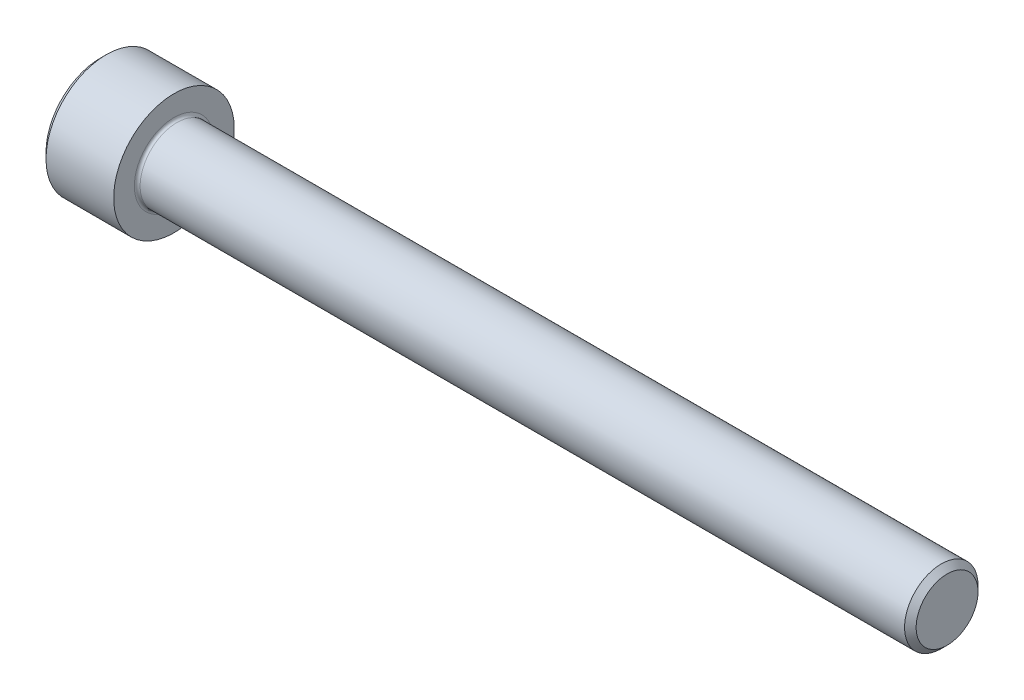
ISO-10303-21;
HEADER;
FILE_DESCRIPTION(('STEP AP214'),'2;1');
FILE_NAME('part.step','',(''),(''),'','','');
FILE_SCHEMA(('AUTOMOTIVE_DESIGN { 1 0 10303 214 1 1 1 1 }'));
ENDSEC;
DATA;
#1=APPLICATION_CONTEXT('core data for automotive mechanical design processes');
#2=APPLICATION_PROTOCOL_DEFINITION('international standard','automotive_design',2000,#1);
#3=PRODUCT_CONTEXT('',#1,'mechanical');
#4=PRODUCT('Part','Part','',(#3));
#5=PRODUCT_RELATED_PRODUCT_CATEGORY('part','',(#4));
#6=PRODUCT_DEFINITION_FORMATION('','',#4);
#7=PRODUCT_DEFINITION_CONTEXT('part definition',#1,'design');
#8=PRODUCT_DEFINITION('design','',#6,#7);
#9=PRODUCT_DEFINITION_SHAPE('','',#8);
#10=(LENGTH_UNIT() NAMED_UNIT(*) SI_UNIT(.MILLI.,.METRE.));
#11=(NAMED_UNIT(*) PLANE_ANGLE_UNIT() SI_UNIT($,.RADIAN.));
#12=(NAMED_UNIT(*) SI_UNIT($,.STERADIAN.) SOLID_ANGLE_UNIT());
#13=UNCERTAINTY_MEASURE_WITH_UNIT(LENGTH_MEASURE(1.E-05),#10,'distance_accuracy_value','');
#14=(GEOMETRIC_REPRESENTATION_CONTEXT(3) GLOBAL_UNCERTAINTY_ASSIGNED_CONTEXT((#13)) GLOBAL_UNIT_ASSIGNED_CONTEXT((#10,
#11,#12)) REPRESENTATION_CONTEXT('',''));
#15=CARTESIAN_POINT('',(0.,0.,0.));
#16=DIRECTION('',(0.,0.,1.));
#17=DIRECTION('',(1.,0.,0.));
#18=AXIS2_PLACEMENT_3D('',#15,#16,#17);
#19=CARTESIAN_POINT('',(0.,0.,0.));
#20=DIRECTION('',(-1.,0.,0.));
#21=DIRECTION('',(0.,0.,1.));
#22=AXIS2_PLACEMENT_3D('',#19,#20,#21);
#23=PLANE('',#22);
#24=CARTESIAN_POINT('',(0.,0.,0.));
#25=DIRECTION('',(-1.,0.,0.));
#26=DIRECTION('',(0.,0.,1.));
#27=AXIS2_PLACEMENT_3D('',#24,#25,#26);
#28=CIRCLE('',#27,3.58139999999999);
#29=CARTESIAN_POINT('',(0.,0.,3.58139999999999));
#30=VERTEX_POINT('',#29);
#31=EDGE_CURVE('E188',#30,#30,#28,.T.);
#32=ORIENTED_EDGE('',*,*,#31,.T.);
#33=EDGE_LOOP('',(#32));
#34=FACE_BOUND('',#33,.T.);
#35=CARTESIAN_POINT('',(0.,0.,0.));
#36=DIRECTION('',(1.,0.,0.));
#37=DIRECTION('',(0.,0.,-1.));
#38=AXIS2_PLACEMENT_3D('',#35,#36,#37);
#39=CIRCLE('',#38,2.29135888084633);
#40=CARTESIAN_POINT('',(0.,1.984375,1.14567944042316));
#41=VERTEX_POINT('',#40);
#42=CARTESIAN_POINT('',(0.,0.,2.29135888084633));
#43=VERTEX_POINT('',#42);
#44=EDGE_CURVE('E107',#41,#43,#39,.T.);
#45=ORIENTED_EDGE('',*,*,#44,.T.);
#46=CARTESIAN_POINT('',(0.,-1.984375,1.14567944042316));
#47=VERTEX_POINT('',#46);
#48=EDGE_CURVE('E135',#43,#47,#39,.T.);
#49=ORIENTED_EDGE('',*,*,#48,.T.);
#50=CARTESIAN_POINT('',(0.,-1.984375,-1.14567944042317));
#51=VERTEX_POINT('',#50);
#52=EDGE_CURVE('E134',#47,#51,#39,.T.);
#53=ORIENTED_EDGE('',*,*,#52,.T.);
#54=CARTESIAN_POINT('',(0.,0.,-2.29135888084633));
#55=VERTEX_POINT('',#54);
#56=EDGE_CURVE('E133',#51,#55,#39,.T.);
#57=ORIENTED_EDGE('',*,*,#56,.T.);
#58=CARTESIAN_POINT('',(0.,1.984375,-1.14567944042316));
#59=VERTEX_POINT('',#58);
#60=EDGE_CURVE('E106',#55,#59,#39,.T.);
#61=ORIENTED_EDGE('',*,*,#60,.T.);
#62=EDGE_CURVE('E99',#59,#41,#39,.T.);
#63=ORIENTED_EDGE('',*,*,#62,.T.);
#64=EDGE_LOOP('',(#45,#49,#53,#57,#61,#63));
#65=FACE_BOUND('',#64,.T.);
#66=ADVANCED_FACE('F39',(#34,#65),#23,.T.);
#67=CARTESIAN_POINT('',(55.626,0.,0.));
#68=DIRECTION('',(1.,0.,0.));
#69=DIRECTION('',(0.,0.,-1.));
#70=AXIS2_PLACEMENT_3D('',#67,#68,#69);
#71=CYLINDRICAL_SURFACE('',#70,3.9624);
#72=CARTESIAN_POINT('',(0.381000000000006,0.,0.));
#73=DIRECTION('',(-1.,0.,0.));
#74=DIRECTION('',(0.,0.,1.));
#75=AXIS2_PLACEMENT_3D('',#72,#73,#74);
#76=CIRCLE('',#75,3.9624);
#77=CARTESIAN_POINT('',(0.381000000000006,0.,3.9624));
#78=VERTEX_POINT('',#77);
#79=EDGE_CURVE('E185',#78,#78,#76,.F.);
#80=ORIENTED_EDGE('',*,*,#79,.T.);
#81=EDGE_LOOP('',(#80));
#82=FACE_BOUND('',#81,.T.);
#83=CARTESIAN_POINT('',(4.826,0.,0.));
#84=DIRECTION('',(1.,0.,0.));
#85=DIRECTION('',(0.,0.,-1.));
#86=AXIS2_PLACEMENT_3D('',#83,#84,#85);
#87=CIRCLE('',#86,3.9624);
#88=CARTESIAN_POINT('',(4.826,0.,-3.9624));
#89=VERTEX_POINT('',#88);
#90=EDGE_CURVE('E176',#89,#89,#87,.T.);
#91=ORIENTED_EDGE('',*,*,#90,.F.);
#92=EDGE_LOOP('',(#91));
#93=FACE_BOUND('',#92,.T.);
#94=ADVANCED_FACE('F223',(#82,#93),#71,.T.);
#95=CARTESIAN_POINT('',(4.826,0.,-3.9624));
#96=DIRECTION('',(1.,0.,0.));
#97=DIRECTION('',(0.,0.,-1.));
#98=AXIS2_PLACEMENT_3D('',#95,#96,#97);
#99=PLANE('',#98);
#100=CARTESIAN_POINT('',(4.826,0.,0.));
#101=DIRECTION('',(1.,0.,0.));
#102=DIRECTION('',(0.,0.,-1.));
#103=AXIS2_PLACEMENT_3D('',#100,#101,#102);
#104=CIRCLE('',#103,2.60349999999999);
#105=CARTESIAN_POINT('',(4.826,0.,-2.60349999999999));
#106=VERTEX_POINT('',#105);
#107=EDGE_CURVE('E53',#106,#106,#104,.F.);
#108=ORIENTED_EDGE('',*,*,#107,.T.);
#109=EDGE_LOOP('',(#108));
#110=FACE_BOUND('',#109,.T.);
#111=ORIENTED_EDGE('',*,*,#90,.T.);
#112=EDGE_LOOP('',(#111));
#113=FACE_BOUND('',#112,.T.);
#114=ADVANCED_FACE('F196',(#110,#113),#99,.T.);
#115=CARTESIAN_POINT('',(55.626,0.,0.));
#116=DIRECTION('',(1.,0.,0.));
#117=DIRECTION('',(0.,0.,-1.));
#118=AXIS2_PLACEMENT_3D('',#115,#116,#117);
#119=CYLINDRICAL_SURFACE('',#118,2.41299999999999);
#120=CARTESIAN_POINT('',(5.0165,0.,0.));
#121=DIRECTION('',(1.,0.,0.));
#122=DIRECTION('',(0.,0.,-1.));
#123=AXIS2_PLACEMENT_3D('',#120,#121,#122);
#124=CIRCLE('',#123,2.41299999999999);
#125=CARTESIAN_POINT('',(5.0165,0.,-2.41299999999999));
#126=VERTEX_POINT('',#125);
#127=EDGE_CURVE('E191',#126,#126,#124,.T.);
#128=ORIENTED_EDGE('',*,*,#127,.T.);
#129=EDGE_LOOP('',(#128));
#130=FACE_BOUND('',#129,.T.);
#131=CARTESIAN_POINT('',(55.245,0.,0.));
#132=DIRECTION('',(1.,0.,0.));
#133=DIRECTION('',(0.,0.,-1.));
#134=AXIS2_PLACEMENT_3D('',#131,#132,#133);
#135=CIRCLE('',#134,2.41299999999999);
#136=CARTESIAN_POINT('',(55.245,0.,-2.413));
#137=VERTEX_POINT('',#136);
#138=EDGE_CURVE('E182',#137,#137,#135,.F.);
#139=ORIENTED_EDGE('',*,*,#138,.T.);
#140=EDGE_LOOP('',(#139));
#141=FACE_BOUND('',#140,.T.);
#142=ADVANCED_FACE('F204',(#130,#141),#119,.T.);
#143=CARTESIAN_POINT('',(55.626,0.,-2.413));
#144=DIRECTION('',(1.,0.,0.));
#145=DIRECTION('',(0.,0.,-1.));
#146=AXIS2_PLACEMENT_3D('',#143,#144,#145);
#147=PLANE('',#146);
#148=CARTESIAN_POINT('',(55.626,0.,0.));
#149=DIRECTION('',(1.,0.,0.));
#150=DIRECTION('',(0.,0.,-1.));
#151=AXIS2_PLACEMENT_3D('',#148,#149,#150);
#152=CIRCLE('',#151,2.03199999999999);
#153=CARTESIAN_POINT('',(55.626,0.,-2.03199999999999));
#154=VERTEX_POINT('',#153);
#155=EDGE_CURVE('E179',#154,#154,#152,.T.);
#156=ORIENTED_EDGE('',*,*,#155,.T.);
#157=EDGE_LOOP('',(#156));
#158=FACE_BOUND('',#157,.T.);
#159=ADVANCED_FACE('F207',(#158),#147,.T.);
#160=CARTESIAN_POINT('',(55.626,0.,0.));
#161=DIRECTION('',(-1.,0.,0.));
#162=DIRECTION('',(0.,0.,1.));
#163=AXIS2_PLACEMENT_3D('',#160,#161,#162);
#164=CONICAL_SURFACE('',#163,2.03199999999999,0.785398163397443);
#165=ORIENTED_EDGE('',*,*,#138,.F.);
#166=EDGE_LOOP('',(#165));
#167=FACE_BOUND('',#166,.T.);
#168=ORIENTED_EDGE('',*,*,#155,.F.);
#169=EDGE_LOOP('',(#168));
#170=FACE_BOUND('',#169,.T.);
#171=ADVANCED_FACE('F211',(#167,#170),#164,.T.);
#172=CARTESIAN_POINT('',(0.381000000000006,0.,0.));
#173=DIRECTION('',(1.,0.,0.));
#174=DIRECTION('',(0.,0.,-1.));
#175=AXIS2_PLACEMENT_3D('',#172,#173,#174);
#176=CONICAL_SURFACE('',#175,3.9624,0.78539816339745);
#177=ORIENTED_EDGE('',*,*,#31,.F.);
#178=EDGE_LOOP('',(#177));
#179=FACE_BOUND('',#178,.T.);
#180=ORIENTED_EDGE('',*,*,#79,.F.);
#181=EDGE_LOOP('',(#180));
#182=FACE_BOUND('',#181,.T.);
#183=ADVANCED_FACE('F201',(#179,#182),#176,.T.);
#184=CARTESIAN_POINT('',(5.0165,0.,0.));
#185=DIRECTION('',(1.,0.,0.));
#186=DIRECTION('',(0.,0.,-1.));
#187=AXIS2_PLACEMENT_3D('',#184,#185,#186);
#188=TOROIDAL_SURFACE('',#187,2.60349999999999,0.1905);
#189=ORIENTED_EDGE('',*,*,#107,.F.);
#190=EDGE_LOOP('',(#189));
#191=FACE_BOUND('',#190,.T.);
#192=ORIENTED_EDGE('',*,*,#127,.F.);
#193=EDGE_LOOP('',(#192));
#194=FACE_BOUND('',#193,.T.);
#195=ADVANCED_FACE('F41',(#191,#194),#188,.F.);
#196=CARTESIAN_POINT('',(0.,0.,0.));
#197=DIRECTION('',(-1.,0.,0.));
#198=DIRECTION('',(0.,0.,-1.));
#199=AXIS2_PLACEMENT_3D('',#196,#197,#198);
#200=CONICAL_SURFACE('',#199,2.29135888084633,0.78539816339745);
#201=CARTESIAN_POINT('',(-0.000115478781842915,-0.000199999999999134,-2.29147435090017));
#202=CARTESIAN_POINT('',(0.0392371477360851,0.0680159951668033,-2.25208982772757));
#203=CARTESIAN_POINT('',(0.0762786895538152,0.137372685106967,-2.21204672412052));
#204=CARTESIAN_POINT('',(0.144101141576677,0.278798800452189,-2.13039431835551));
#205=CARTESIAN_POINT('',(0.174844310908247,0.350881678736784,-2.08877724917394));
#206=CARTESIAN_POINT('',(0.227508111188787,0.496233397266005,-2.00485839535392));
#207=CARTESIAN_POINT('',(0.249561124120036,0.56946521248694,-1.96257798712287));
#208=CARTESIAN_POINT('',(0.283538507056124,0.717541182594707,-1.87708628592063));
#209=CARTESIAN_POINT('',(0.295488243908271,0.792380812753426,-1.83387760530244));
#210=CARTESIAN_POINT('',(0.306269900918094,0.921360414543817,-1.75941119748879));
#211=CARTESIAN_POINT('',(0.307866100940931,0.975333715772444,-1.72824969749539));
#212=CARTESIAN_POINT('',(0.305178161134708,1.0831921185198,-1.66597761963484));
#213=CARTESIAN_POINT('',(0.300891959659541,1.13707718248553,-1.63486706344893));
#214=CARTESIAN_POINT('',(0.286683126986481,1.24433853824861,-1.57293969082547));
#215=CARTESIAN_POINT('',(0.276754189547727,1.29771419276014,-1.54212324232506));
#216=CARTESIAN_POINT('',(0.251804915725461,1.4035425174089,-1.48102323060122));
#217=CARTESIAN_POINT('',(0.236784969610511,1.4559952579711,-1.45073962671789));
#218=CARTESIAN_POINT('',(0.19219214836433,1.59035733896365,-1.37316564308797));
#219=CARTESIAN_POINT('',(0.159257004061667,1.67143335715833,-1.32635638215845));
#220=CARTESIAN_POINT('',(0.103657558797803,1.79064830672984,-1.25752759893191));
#221=CARTESIAN_POINT('',(0.0841224079481373,1.829934924386,-1.23484545965257));
#222=CARTESIAN_POINT('',(0.043271261880598,1.90778036186805,-1.18990137536713));
#223=CARTESIAN_POINT('',(0.0219563604316492,1.9463396111017,-1.16763918244233));
#224=CARTESIAN_POINT('',(-0.000115478781843039,1.984575,-1.14556397036933));
#225=B_SPLINE_CURVE_WITH_KNOTS('',3,(#201,#202,#203,#204,#205,#206,#207,#208,#209,#210,#211,
#212,#213,#214,#215,#216,#217,#218,#219,#220,#221,#222,#223,#224),.UNSPECIFIED.,.F.,.F.,(4,2,2,
2,2,2,2,2,2,2,2,4),(0.,0.264339630306627,0.530219665093695,0.791876416371461,1.05287424418109,
1.239639843932,1.42647091743852,1.61351120244035,1.8005371524754,2.09764209964316,
2.24579179873714,2.39385111134157),.UNSPECIFIED.);
#226=EDGE_CURVE('E11',#55,#59,#225,.T.);
#227=ORIENTED_EDGE('',*,*,#226,.T.);
#228=ORIENTED_EDGE('',*,*,#60,.F.);
#229=EDGE_LOOP('',(#227,#228));
#230=FACE_BOUND('',#229,.T.);
#231=ADVANCED_FACE('F111',(#230),#200,.F.);
#232=CARTESIAN_POINT('',(-0.734984078816568,1.984375,-2.28495242157822));
#233=CARTESIAN_POINT('',(-0.692986685550761,1.984375,-2.22931635455402));
#234=CARTESIAN_POINT('',(-0.651396054076335,1.984375,-2.17336876548389));
#235=CARTESIAN_POINT('',(-0.569208461471479,1.984375,-2.06072770258171));
#236=CARTESIAN_POINT('',(-0.528611752405042,1.984375,-2.00403404503435));
#237=CARTESIAN_POINT('',(-0.448303503174669,1.984375,-1.88936329173488));
#238=CARTESIAN_POINT('',(-0.408601258813307,1.984375,-1.83137965519348));
#239=CARTESIAN_POINT('',(-0.330685173401292,1.984375,-1.7144280213784));
#240=CARTESIAN_POINT('',(-0.292471227194368,1.984375,-1.65546009407228));
#241=CARTESIAN_POINT('',(-0.176252834013637,1.984375,-1.47005472306035));
#242=CARTESIAN_POINT('',(-0.101347886872382,1.984375,-1.34163909427883));
#243=CARTESIAN_POINT('',(0.0356697845602625,1.984375,-1.0784038470548));
#244=CARTESIAN_POINT('',(0.0978256335176257,1.984375,-0.943607781407425));
#245=CARTESIAN_POINT('',(0.173867421311381,1.984375,-0.741275100444882));
#246=CARTESIAN_POINT('',(0.195691938673995,1.984375,-0.676735408881095));
#247=CARTESIAN_POINT('',(0.234159536462205,1.984375,-0.546098118112762));
#248=CARTESIAN_POINT('',(0.250802259934452,1.984375,-0.480000411919956));
#249=CARTESIAN_POINT('',(0.277764619130277,1.984375,-0.347746170028532));
#250=CARTESIAN_POINT('',(0.288192590264108,1.984375,-0.281612071479123));
#251=CARTESIAN_POINT('',(0.302521852623404,1.984375,-0.14863662005235));
#252=CARTESIAN_POINT('',(0.306424265772614,1.984375,-0.0817953907393236));
#253=CARTESIAN_POINT('',(0.307412948667328,1.984375,0.0495156750890645));
#254=CARTESIAN_POINT('',(0.304740821124985,1.984375,0.113983775102992));
#255=CARTESIAN_POINT('',(0.293260789502485,1.984375,0.242367515846177));
#256=CARTESIAN_POINT('',(0.284452289360786,1.984375,0.30628310229592));
#257=CARTESIAN_POINT('',(0.261030978667103,1.984375,0.434181040262184));
#258=CARTESIAN_POINT('',(0.246319393767914,1.984375,0.49814502685831));
#259=CARTESIAN_POINT('',(0.211873818587874,1.984375,0.624675616953008));
#260=CARTESIAN_POINT('',(0.192140248550805,1.984375,0.687242336899689));
#261=CARTESIAN_POINT('',(0.12258776276924,1.984375,0.884225483826088));
#262=CARTESIAN_POINT('',(0.0648475887435033,1.984375,1.01583674256468));
#263=CARTESIAN_POINT('',(-0.063530336588798,1.984375,1.27288659242652));
#264=CARTESIAN_POINT('',(-0.134214424919413,1.984375,1.3983008827048));
#265=CARTESIAN_POINT('',(-0.244516663813199,1.984375,1.57956687990221));
#266=CARTESIAN_POINT('',(-0.280969829475363,1.984375,1.63738271299424));
#267=CARTESIAN_POINT('',(-0.355415963291704,1.984375,1.75202215386202));
#268=CARTESIAN_POINT('',(-0.393409048078054,1.984375,1.80884568601362));
#269=CARTESIAN_POINT('',(-0.47033880889309,1.984375,1.92116923084255));
#270=CARTESIAN_POINT('',(-0.50926531303879,1.984375,1.97667624512253));
#271=CARTESIAN_POINT('',(-0.588147746121386,1.984375,2.08693170717166));
#272=CARTESIAN_POINT('',(-0.628103389024029,1.984375,2.14168035934793));
#273=CARTESIAN_POINT('',(-0.668480611285426,1.984375,2.19611149046622));
#274=B_SPLINE_CURVE_WITH_KNOTS('',3,(#232,#233,#234,#235,#236,#237,#238,#239,#240,#241,#242,
#243,#244,#245,#246,#247,#248,#249,#250,#251,#252,#253,#254,#255,#256,#257,#258,#259,#260,#261,
#262,#263,#264,#265,#266,#267,#268,#269,#270,#271,#272,#273),.UNSPECIFIED.,.F.,.F.,(4,2,2,2,2,2,
2,2,2,2,2,2,2,2,2,2,2,2,2,2,4),(0.,0.209126070008322,0.418304637356569,0.629103979977992,
0.839888401371185,1.28549951116127,1.72957750768351,1.93379389749971,2.13802435186698,
2.33858179514334,2.53910475350639,2.73236963400794,2.92565329006887,3.12231577097487,
3.31896180041345,3.74886295245172,4.18033428125362,4.3853601718029,4.59040161996383,
4.79377749165107,4.99709743524131),.UNSPECIFIED.);
#275=EDGE_CURVE('E102',#59,#41,#274,.T.);
#276=ORIENTED_EDGE('',*,*,#275,.T.);
#277=ORIENTED_EDGE('',*,*,#62,.F.);
#278=EDGE_LOOP('',(#276,#277));
#279=FACE_BOUND('',#278,.T.);
#280=ADVANCED_FACE('F100',(#279),#200,.F.);
#281=CARTESIAN_POINT('',(-0.000115478781843782,1.984575,1.14556397036933));
#282=CARTESIAN_POINT('',(0.0392371477360843,1.9163590048332,1.18494849354192));
#283=CARTESIAN_POINT('',(0.0762786895538144,1.84700231489303,1.22499159714897));
#284=CARTESIAN_POINT('',(0.144101141576676,1.70557619954781,1.30664400291398));
#285=CARTESIAN_POINT('',(0.174844310908246,1.63349332126322,1.34826107209555));
#286=CARTESIAN_POINT('',(0.227508111188786,1.488141602734,1.43217992591557));
#287=CARTESIAN_POINT('',(0.249561124120035,1.41490978751306,1.47446033414663));
#288=CARTESIAN_POINT('',(0.283538507056123,1.26683381740529,1.55995203534886));
#289=CARTESIAN_POINT('',(0.295488243908271,1.19199418724658,1.60316071596705));
#290=CARTESIAN_POINT('',(0.306269900918094,1.06301458545619,1.6776271237807));
#291=CARTESIAN_POINT('',(0.30786610094093,1.00904128422756,1.7087886237741));
#292=CARTESIAN_POINT('',(0.305178161134707,0.9011828814802,1.77106070163465));
#293=CARTESIAN_POINT('',(0.30089195965954,0.847297817514477,1.80217125782056));
#294=CARTESIAN_POINT('',(0.286683126986481,0.740036461751396,1.86409863044402));
#295=CARTESIAN_POINT('',(0.276754189547727,0.68666080723986,1.89491507894443));
#296=CARTESIAN_POINT('',(0.251804915725461,0.580832482591104,1.95601509066828));
#297=CARTESIAN_POINT('',(0.236784969610511,0.528379742028899,1.9862986945516));
#298=CARTESIAN_POINT('',(0.19219214836433,0.394017661036352,2.06387267818152));
#299=CARTESIAN_POINT('',(0.159257004061667,0.312941642841676,2.11068193911104));
#300=CARTESIAN_POINT('',(0.103657558797803,0.193726693270161,2.17951072233758));
#301=CARTESIAN_POINT('',(0.0841224079481376,0.154440075614,2.20219286161692));
#302=CARTESIAN_POINT('',(0.0432712618805985,0.0765946381319484,2.24713694590237));
#303=CARTESIAN_POINT('',(0.0219563604316497,0.0380353888983027,2.26939913882716));
#304=CARTESIAN_POINT('',(-0.000115478781842592,-0.000199999999998719,2.29147435090017));
#305=B_SPLINE_CURVE_WITH_KNOTS('',3,(#281,#282,#283,#284,#285,#286,#287,#288,#289,#290,#291,
#292,#293,#294,#295,#296,#297,#298,#299,#300,#301,#302,#303,#304),.UNSPECIFIED.,.F.,.F.,(4,2,2,
2,2,2,2,2,2,2,2,4),(0.,0.264339630306626,0.530219665093694,0.79187641637146,1.05287424418109,
1.239639843932,1.42647091743852,1.61351120244035,1.8005371524754,2.09764209964316,
2.24579179873714,2.39385111134157),.UNSPECIFIED.);
#306=EDGE_CURVE('E124',#41,#43,#305,.T.);
#307=ORIENTED_EDGE('',*,*,#306,.T.);
#308=ORIENTED_EDGE('',*,*,#44,.F.);
#309=EDGE_LOOP('',(#307,#308));
#310=FACE_BOUND('',#309,.T.);
#311=ADVANCED_FACE('F140',(#310),#200,.F.);
#312=CARTESIAN_POINT('',(-0.000115478781842732,0.000200000000001384,2.29147435090017));
#313=CARTESIAN_POINT('',(0.0392371477360858,-0.0680159951668012,2.25208982772757));
#314=CARTESIAN_POINT('',(0.0762786895538159,-0.137372685106965,2.21204672412052));
#315=CARTESIAN_POINT('',(0.144101141576678,-0.278798800452186,2.13039431835551));
#316=CARTESIAN_POINT('',(0.174844310908247,-0.350881678736781,2.08877724917394));
#317=CARTESIAN_POINT('',(0.227508111188787,-0.496233397266003,2.00485839535392));
#318=CARTESIAN_POINT('',(0.249561124120037,-0.569465212486937,1.96257798712287));
#319=CARTESIAN_POINT('',(0.283538507056125,-0.717541182594705,1.87708628592063));
#320=CARTESIAN_POINT('',(0.295488243908273,-0.792380812753424,1.83387760530244));
#321=CARTESIAN_POINT('',(0.306269900918095,-0.921360414543815,1.75941119748879));
#322=CARTESIAN_POINT('',(0.307866100940932,-0.975333715772441,1.72824969749539));
#323=CARTESIAN_POINT('',(0.305178161134709,-1.0831921185198,1.66597761963484));
#324=CARTESIAN_POINT('',(0.300891959659542,-1.13707718248552,1.63486706344893));
#325=CARTESIAN_POINT('',(0.286683126986482,-1.2443385382486,1.57293969082547));
#326=CARTESIAN_POINT('',(0.276754189547729,-1.29771419276014,1.54212324232506));
#327=CARTESIAN_POINT('',(0.251804915725463,-1.40354251740889,1.48102323060122));
#328=CARTESIAN_POINT('',(0.236784969610513,-1.4559952579711,1.45073962671789));
#329=CARTESIAN_POINT('',(0.192192148364332,-1.59035733896365,1.37316564308797));
#330=CARTESIAN_POINT('',(0.159257004061669,-1.67143335715832,1.32635638215845));
#331=CARTESIAN_POINT('',(0.103657558797805,-1.79064830672984,1.25752759893191));
#332=CARTESIAN_POINT('',(0.084122407948139,-1.829934924386,1.23484545965257));
#333=CARTESIAN_POINT('',(0.0432712618805997,-1.90778036186805,1.18990137536713));
#334=CARTESIAN_POINT('',(0.0219563604316508,-1.9463396111017,1.16763918244233));
#335=CARTESIAN_POINT('',(-0.000115478781841591,-1.984575,1.14556397036933));
#336=B_SPLINE_CURVE_WITH_KNOTS('',3,(#312,#313,#314,#315,#316,#317,#318,#319,#320,#321,#322,
#323,#324,#325,#326,#327,#328,#329,#330,#331,#332,#333,#334,#335),.UNSPECIFIED.,.F.,.F.,(4,2,2,
2,2,2,2,2,2,2,2,4),(0.,0.264339630306627,0.530219665093695,0.791876416371461,1.05287424418109,
1.239639843932,1.42647091743852,1.61351120244035,1.8005371524754,2.09764209964316,
2.24579179873714,2.39385111134157),.UNSPECIFIED.);
#337=EDGE_CURVE('E141',#43,#47,#336,.T.);
#338=ORIENTED_EDGE('',*,*,#337,.T.);
#339=ORIENTED_EDGE('',*,*,#48,.F.);
#340=EDGE_LOOP('',(#338,#339));
#341=FACE_BOUND('',#340,.T.);
#342=ADVANCED_FACE('F145',(#341),#200,.F.);
#343=CARTESIAN_POINT('',(-0.734984079067574,-1.984375,-2.28495242191067));
#344=CARTESIAN_POINT('',(-0.692986685792101,-1.984375,-2.22931635487714));
#345=CARTESIAN_POINT('',(-0.651396054308022,-1.984375,-2.17336876579766));
#346=CARTESIAN_POINT('',(-0.569208461683915,-1.984375,-2.06072770287667));
#347=CARTESIAN_POINT('',(-0.528611752607882,-1.984375,-2.00403404531985));
#348=CARTESIAN_POINT('',(-0.448303503358245,-1.984375,-1.88936329200117));
#349=CARTESIAN_POINT('',(-0.408601258987222,-1.984375,-1.83137965544999));
#350=CARTESIAN_POINT('',(-0.330685173556039,-1.984375,-1.71442802161519));
#351=CARTESIAN_POINT('',(-0.29247122733961,-1.984375,-1.65546009429911));
#352=CARTESIAN_POINT('',(-0.176252834128705,-1.984375,-1.47005472325436));
#353=CARTESIAN_POINT('',(-0.101347886967268,-1.984375,-1.3416390944495));
#354=CARTESIAN_POINT('',(0.0356697845027927,-1.984375,-1.07840384717678));
#355=CARTESIAN_POINT('',(0.097825633477415,-1.984375,-0.943607781504098));
#356=CARTESIAN_POINT('',(0.173867421283982,-1.984375,-0.74127510052251));
#357=CARTESIAN_POINT('',(0.195691938646096,-1.984375,-0.676735408966699));
#358=CARTESIAN_POINT('',(0.23415953643492,-1.984375,-0.546098118214577));
#359=CARTESIAN_POINT('',(0.250802259908281,-1.984375,-0.480000412030008));
#360=CARTESIAN_POINT('',(0.277764619108202,-1.984375,-0.347746170154785));
#361=CARTESIAN_POINT('',(0.288192590244967,-1.984375,-0.281612071613337));
#362=CARTESIAN_POINT('',(0.30252185261193,-1.984375,-0.14863662020222));
#363=CARTESIAN_POINT('',(0.306424265765872,-1.984375,-0.0817953908968883));
#364=CARTESIAN_POINT('',(0.307412948671393,-1.984375,0.0495156749173032));
#365=CARTESIAN_POINT('',(0.304740821135034,-1.984375,0.113983774924708));
#366=CARTESIAN_POINT('',(0.293260789525433,-1.984375,0.242367515655502));
#367=CARTESIAN_POINT('',(0.28445228939065,-1.984375,0.306283102099375));
#368=CARTESIAN_POINT('',(0.261030978711462,-1.984375,0.434181040054053));
#369=CARTESIAN_POINT('',(0.246319393819896,-1.984375,0.498145026644478));
#370=CARTESIAN_POINT('',(0.21187381865527,-1.984375,0.624675616728325));
#371=CARTESIAN_POINT('',(0.192140248625992,-1.984375,0.687242336669857));
#372=CARTESIAN_POINT('',(0.122587762881156,-1.984375,0.88422548354621));
#373=CARTESIAN_POINT('',(0.0648475888892097,-1.984375,1.01583674224241));
#374=CARTESIAN_POINT('',(-0.063530336371789,-1.984375,1.27288659202273));
#375=CARTESIAN_POINT('',(-0.134214424664866,-1.984375,1.3983008822619));
#376=CARTESIAN_POINT('',(-0.244516663503638,-1.984375,1.57956687940503));
#377=CARTESIAN_POINT('',(-0.280969829148883,-1.984375,1.63738271248117));
#378=CARTESIAN_POINT('',(-0.35541596293131,-1.984375,1.75202215331741));
#379=CARTESIAN_POINT('',(-0.393409047700664,-1.984375,1.80884568545336));
#380=CARTESIAN_POINT('',(-0.470338808481903,-1.984375,1.92116923025136));
#381=CARTESIAN_POINT('',(-0.509265312610805,-1.984375,1.97667624451606));
#382=CARTESIAN_POINT('',(-0.588147745659822,-1.984375,2.08693170653472));
#383=CARTESIAN_POINT('',(-0.628103388545686,-1.984375,2.14168035869581));
#384=CARTESIAN_POINT('',(-0.668480610790326,-1.984375,2.19611148979895));
#385=B_SPLINE_CURVE_WITH_KNOTS('',3,(#343,#344,#345,#346,#347,#348,#349,#350,#351,#352,#353,
#354,#355,#356,#357,#358,#359,#360,#361,#362,#363,#364,#365,#366,#367,#368,#369,#370,#371,#372,
#373,#374,#375,#376,#377,#378,#379,#380,#381,#382,#383,#384),.UNSPECIFIED.,.F.,.F.,(4,2,2,2,2,2,
2,2,2,2,2,2,2,2,2,2,2,2,2,2,4),(0.,0.209126070048127,0.418304637436192,0.629103980098179,
0.839888401531931,1.28549951141299,1.72957750802533,1.93379389781847,2.13802435216272,
2.33858179541699,2.53910475375796,2.7323696342393,2.92565329027999,3.12231577116422,
3.31896180058103,3.74886295246281,4.18033428110719,4.38536017158908,4.59040161968262,
4.7937774913034,4.99709743482717),.UNSPECIFIED.);
#386=EDGE_CURVE('E149',#47,#51,#385,.F.);
#387=ORIENTED_EDGE('',*,*,#386,.T.);
#388=ORIENTED_EDGE('',*,*,#52,.F.);
#389=EDGE_LOOP('',(#387,#388));
#390=FACE_BOUND('',#389,.T.);
#391=ADVANCED_FACE('F256',(#390),#200,.F.);
#392=CARTESIAN_POINT('',(-0.000115478781842481,-1.984575,-1.14556397036933));
#393=CARTESIAN_POINT('',(0.0392371477360859,-1.9163590048332,-1.18494849354192));
#394=CARTESIAN_POINT('',(0.0762786895538159,-1.84700231489303,-1.22499159714897));
#395=CARTESIAN_POINT('',(0.144101141576677,-1.70557619954781,-1.30664400291398));
#396=CARTESIAN_POINT('',(0.174844310908247,-1.63349332126322,-1.34826107209555));
#397=CARTESIAN_POINT('',(0.227508111188787,-1.488141602734,-1.43217992591557));
#398=CARTESIAN_POINT('',(0.249561124120037,-1.41490978751306,-1.47446033414663));
#399=CARTESIAN_POINT('',(0.283538507056125,-1.26683381740529,-1.55995203534886));
#400=CARTESIAN_POINT('',(0.295488243908272,-1.19199418724658,-1.60316071596705));
#401=CARTESIAN_POINT('',(0.306269900918095,-1.06301458545618,-1.6776271237807));
#402=CARTESIAN_POINT('',(0.307866100940931,-1.00904128422756,-1.7087886237741));
#403=CARTESIAN_POINT('',(0.305178161134708,-0.901182881480199,-1.77106070163465));
#404=CARTESIAN_POINT('',(0.300891959659541,-0.847297817514476,-1.80217125782056));
#405=CARTESIAN_POINT('',(0.286683126986481,-0.740036461751395,-1.86409863044402));
#406=CARTESIAN_POINT('',(0.276754189547728,-0.686660807239859,-1.89491507894443));
#407=CARTESIAN_POINT('',(0.251804915725462,-0.580832482591103,-1.95601509066828));
#408=CARTESIAN_POINT('',(0.236784969610512,-0.528379742028898,-1.9862986945516));
#409=CARTESIAN_POINT('',(0.192192148364331,-0.39401766103635,-2.06387267818152));
#410=CARTESIAN_POINT('',(0.159257004061668,-0.312941642841675,-2.11068193911104));
#411=CARTESIAN_POINT('',(0.103657558797804,-0.19372669327016,-2.17951072233758));
#412=CARTESIAN_POINT('',(0.0841224079481381,-0.154440075613998,-2.20219286161692));
#413=CARTESIAN_POINT('',(0.0432712618805988,-0.0765946381319462,-2.24713694590237));
#414=CARTESIAN_POINT('',(0.0219563604316499,-0.0380353888983004,-2.26939913882716));
#415=CARTESIAN_POINT('',(-0.000115478781842418,0.00020000000000105,-2.29147435090017));
#416=B_SPLINE_CURVE_WITH_KNOTS('',3,(#392,#393,#394,#395,#396,#397,#398,#399,#400,#401,#402,
#403,#404,#405,#406,#407,#408,#409,#410,#411,#412,#413,#414,#415),.UNSPECIFIED.,.F.,.F.,(4,2,2,
2,2,2,2,2,2,2,2,4),(0.,0.264339630306626,0.530219665093694,0.79187641637146,1.05287424418109,
1.239639843932,1.42647091743852,1.61351120244035,1.8005371524754,2.09764209964316,
2.24579179873714,2.39385111134157),.UNSPECIFIED.);
#417=EDGE_CURVE('E59',#51,#55,#416,.T.);
#418=ORIENTED_EDGE('',*,*,#417,.T.);
#419=ORIENTED_EDGE('',*,*,#56,.F.);
#420=EDGE_LOOP('',(#418,#419));
#421=FACE_BOUND('',#420,.T.);
#422=ADVANCED_FACE('F234',(#421),#200,.F.);
#423=CARTESIAN_POINT('',(3.21733333333333,0.,0.));
#424=DIRECTION('',(1.,0.,0.));
#425=DIRECTION('',(0.,0.,-1.));
#426=AXIS2_PLACEMENT_3D('',#423,#424,#425);
#427=PLANE('',#426);
#428=DIRECTION('',(0.,-0.866025403784439,-0.5));
#429=VECTOR('',#428,1.);
#430=CARTESIAN_POINT('',(3.21733333333333,1.984375,-1.14567944042316));
#431=LINE('',#430,#429);
#432=CARTESIAN_POINT('',(3.21733333333333,1.984375,-1.14567944042316));
#433=VERTEX_POINT('',#432);
#434=CARTESIAN_POINT('',(3.21733333333333,0.,-2.29135888084633));
#435=VERTEX_POINT('',#434);
#436=EDGE_CURVE('E128',#433,#435,#431,.T.);
#437=ORIENTED_EDGE('',*,*,#436,.T.);
#438=DIRECTION('',(0.,-0.866025403784439,0.5));
#439=VECTOR('',#438,1.);
#440=CARTESIAN_POINT('',(3.21733333333333,0.,-2.29135888084633));
#441=LINE('',#440,#439);
#442=CARTESIAN_POINT('',(3.21733333333333,-1.984375,-1.14567944042316));
#443=VERTEX_POINT('',#442);
#444=EDGE_CURVE('E173',#435,#443,#441,.T.);
#445=ORIENTED_EDGE('',*,*,#444,.T.);
#446=DIRECTION('',(0.,0.,1.));
#447=VECTOR('',#446,1.);
#448=CARTESIAN_POINT('',(3.21733333333333,-1.984375,-1.14567944042316));
#449=LINE('',#448,#447);
#450=CARTESIAN_POINT('',(3.21733333333333,-1.984375,1.14567944042316));
#451=VERTEX_POINT('',#450);
#452=EDGE_CURVE('E165',#443,#451,#449,.T.);
#453=ORIENTED_EDGE('',*,*,#452,.T.);
#454=DIRECTION('',(0.,0.866025403784439,0.5));
#455=VECTOR('',#454,1.);
#456=CARTESIAN_POINT('',(3.21733333333333,-1.984375,1.14567944042316));
#457=LINE('',#456,#455);
#458=CARTESIAN_POINT('',(3.21733333333333,0.,2.29135888084633));
#459=VERTEX_POINT('',#458);
#460=EDGE_CURVE('E164',#451,#459,#457,.T.);
#461=ORIENTED_EDGE('',*,*,#460,.T.);
#462=DIRECTION('',(0.,0.866025403784439,-0.5));
#463=VECTOR('',#462,1.);
#464=CARTESIAN_POINT('',(3.21733333333333,0.,2.29135888084633));
#465=LINE('',#464,#463);
#466=CARTESIAN_POINT('',(3.21733333333333,1.984375,1.14567944042317));
#467=VERTEX_POINT('',#466);
#468=EDGE_CURVE('E443',#459,#467,#465,.T.);
#469=ORIENTED_EDGE('',*,*,#468,.T.);
#470=DIRECTION('',(0.,0.,-1.));
#471=VECTOR('',#470,1.);
#472=CARTESIAN_POINT('',(3.21733333333333,1.984375,1.14567944042317));
#473=LINE('',#472,#471);
#474=EDGE_CURVE('E129',#467,#433,#473,.T.);
#475=ORIENTED_EDGE('',*,*,#474,.T.);
#476=EDGE_LOOP('',(#437,#445,#453,#461,#469,#475));
#477=FACE_BOUND('',#476,.T.);
#478=ADVANCED_FACE('F231',(#477),#427,.F.);
#479=CARTESIAN_POINT('',(9.279699096452,1.984375,-1.14567944042316));
#480=DIRECTION('',(0.,0.5,-0.866025403784438));
#481=DIRECTION('',(0.,0.866025403784439,0.5));
#482=AXIS2_PLACEMENT_3D('',#479,#480,#481);
#483=PLANE('',#482);
#484=ORIENTED_EDGE('',*,*,#226,.F.);
#485=DIRECTION('',(-1.,0.,0.));
#486=VECTOR('',#485,1.);
#487=CARTESIAN_POINT('',(9.279699096452,0.,-2.29135888084633));
#488=LINE('',#487,#486);
#489=EDGE_CURVE('E174',#435,#55,#488,.T.);
#490=ORIENTED_EDGE('',*,*,#489,.F.);
#491=ORIENTED_EDGE('',*,*,#436,.F.);
#492=DIRECTION('',(-1.,0.,0.));
#493=VECTOR('',#492,1.);
#494=CARTESIAN_POINT('',(9.279699096452,1.984375,-1.14567944042316));
#495=LINE('',#494,#493);
#496=EDGE_CURVE('E120',#433,#59,#495,.T.);
#497=ORIENTED_EDGE('',*,*,#496,.T.);
#498=EDGE_LOOP('',(#484,#490,#491,#497));
#499=FACE_BOUND('',#498,.T.);
#500=ADVANCED_FACE('F126',(#499),#483,.F.);
#501=CARTESIAN_POINT('',(9.279699096452,1.984375,1.14567944042317));
#502=DIRECTION('',(0.,1.,0.));
#503=DIRECTION('',(0.,0.,1.));
#504=AXIS2_PLACEMENT_3D('',#501,#502,#503);
#505=PLANE('',#504);
#506=ORIENTED_EDGE('',*,*,#275,.F.);
#507=ORIENTED_EDGE('',*,*,#496,.F.);
#508=ORIENTED_EDGE('',*,*,#474,.F.);
#509=DIRECTION('',(-1.,0.,0.));
#510=VECTOR('',#509,1.);
#511=CARTESIAN_POINT('',(9.279699096452,1.984375,1.14567944042317));
#512=LINE('',#511,#510);
#513=EDGE_CURVE('E123',#467,#41,#512,.T.);
#514=ORIENTED_EDGE('',*,*,#513,.T.);
#515=EDGE_LOOP('',(#506,#507,#508,#514));
#516=FACE_BOUND('',#515,.T.);
#517=ADVANCED_FACE('F119',(#516),#505,.F.);
#518=CARTESIAN_POINT('',(9.279699096452,0.,2.29135888084633));
#519=DIRECTION('',(0.,0.5,0.866025403784439));
#520=DIRECTION('',(0.,-0.866025403784439,0.5));
#521=AXIS2_PLACEMENT_3D('',#518,#519,#520);
#522=PLANE('',#521);
#523=ORIENTED_EDGE('',*,*,#306,.F.);
#524=ORIENTED_EDGE('',*,*,#513,.F.);
#525=ORIENTED_EDGE('',*,*,#468,.F.);
#526=DIRECTION('',(-1.,0.,0.));
#527=VECTOR('',#526,1.);
#528=CARTESIAN_POINT('',(9.279699096452,0.,2.29135888084633));
#529=LINE('',#528,#527);
#530=EDGE_CURVE('E67',#459,#43,#529,.T.);
#531=ORIENTED_EDGE('',*,*,#530,.T.);
#532=EDGE_LOOP('',(#523,#524,#525,#531));
#533=FACE_BOUND('',#532,.T.);
#534=ADVANCED_FACE('F279',(#533),#522,.F.);
#535=CARTESIAN_POINT('',(9.279699096452,-1.984375,1.14567944042316));
#536=DIRECTION('',(0.,-0.5,0.866025403784438));
#537=DIRECTION('',(0.,-0.866025403784439,-0.5));
#538=AXIS2_PLACEMENT_3D('',#535,#536,#537);
#539=PLANE('',#538);
#540=ORIENTED_EDGE('',*,*,#337,.F.);
#541=ORIENTED_EDGE('',*,*,#530,.F.);
#542=ORIENTED_EDGE('',*,*,#460,.F.);
#543=DIRECTION('',(-1.,0.,0.));
#544=VECTOR('',#543,1.);
#545=CARTESIAN_POINT('',(9.279699096452,-1.984375,1.14567944042316));
#546=LINE('',#545,#544);
#547=EDGE_CURVE('E156',#451,#47,#546,.T.);
#548=ORIENTED_EDGE('',*,*,#547,.T.);
#549=EDGE_LOOP('',(#540,#541,#542,#548));
#550=FACE_BOUND('',#549,.T.);
#551=ADVANCED_FACE('F162',(#550),#539,.F.);
#552=CARTESIAN_POINT('',(9.279699096452,-1.984375,-1.14567944042316));
#553=DIRECTION('',(0.,-1.,0.));
#554=DIRECTION('',(0.,0.,-1.));
#555=AXIS2_PLACEMENT_3D('',#552,#553,#554);
#556=PLANE('',#555);
#557=ORIENTED_EDGE('',*,*,#386,.F.);
#558=ORIENTED_EDGE('',*,*,#547,.F.);
#559=ORIENTED_EDGE('',*,*,#452,.F.);
#560=DIRECTION('',(-1.,0.,0.));
#561=VECTOR('',#560,1.);
#562=CARTESIAN_POINT('',(9.279699096452,-1.984375,-1.14567944042316));
#563=LINE('',#562,#561);
#564=EDGE_CURVE('E159',#443,#51,#563,.T.);
#565=ORIENTED_EDGE('',*,*,#564,.T.);
#566=EDGE_LOOP('',(#557,#558,#559,#565));
#567=FACE_BOUND('',#566,.T.);
#568=ADVANCED_FACE('F155',(#567),#556,.F.);
#569=CARTESIAN_POINT('',(9.279699096452,0.,-2.29135888084633));
#570=DIRECTION('',(0.,-0.5,-0.866025403784439));
#571=DIRECTION('',(0.,0.866025403784439,-0.5));
#572=AXIS2_PLACEMENT_3D('',#569,#570,#571);
#573=PLANE('',#572);
#574=ORIENTED_EDGE('',*,*,#417,.F.);
#575=ORIENTED_EDGE('',*,*,#564,.F.);
#576=ORIENTED_EDGE('',*,*,#444,.F.);
#577=ORIENTED_EDGE('',*,*,#489,.T.);
#578=EDGE_LOOP('',(#574,#575,#576,#577));
#579=FACE_BOUND('',#578,.T.);
#580=ADVANCED_FACE('F236',(#579),#573,.F.);
#581=CLOSED_SHELL('',(#66,#94,#114,#142,#159,#171,#183,#195,#231,#280,#311,#342,#391,#422,#478,
#500,#517,#534,#551,#568,#580));
#582=MANIFOLD_SOLID_BREP('B2',#581);
#583=ADVANCED_BREP_SHAPE_REPRESENTATION('',(#18,#582),#14);
#584=SHAPE_DEFINITION_REPRESENTATION(#9,#583);
ENDSEC;
END-ISO-10303-21;
